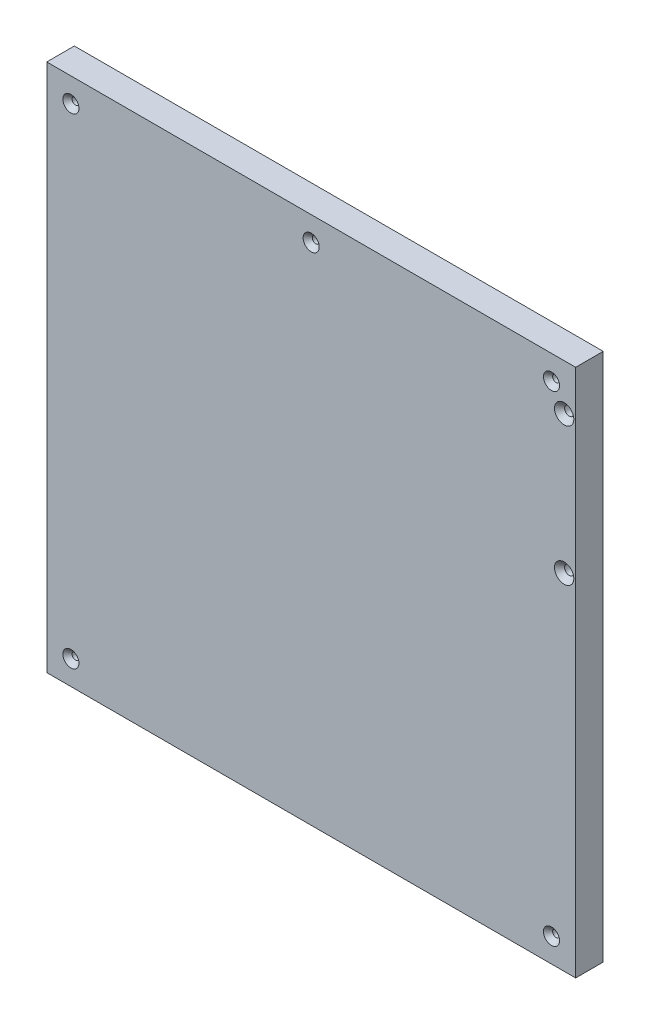
ISO-10303-21;
HEADER;
FILE_DESCRIPTION(('STEP AP214'),'2;1');
FILE_NAME('part.step','',(''),(''),'','','');
FILE_SCHEMA(('AUTOMOTIVE_DESIGN { 1 0 10303 214 1 1 1 1 }'));
ENDSEC;
DATA;
#1=APPLICATION_CONTEXT('core data for automotive mechanical design processes');
#2=APPLICATION_PROTOCOL_DEFINITION('international standard','automotive_design',2000,#1);
#3=PRODUCT_CONTEXT('',#1,'mechanical');
#4=PRODUCT('Part','Part','',(#3));
#5=PRODUCT_RELATED_PRODUCT_CATEGORY('part','',(#4));
#6=PRODUCT_DEFINITION_FORMATION('','',#4);
#7=PRODUCT_DEFINITION_CONTEXT('part definition',#1,'design');
#8=PRODUCT_DEFINITION('design','',#6,#7);
#9=PRODUCT_DEFINITION_SHAPE('','',#8);
#10=(LENGTH_UNIT() NAMED_UNIT(*) SI_UNIT(.MILLI.,.METRE.));
#11=(NAMED_UNIT(*) PLANE_ANGLE_UNIT() SI_UNIT($,.RADIAN.));
#12=(NAMED_UNIT(*) SI_UNIT($,.STERADIAN.) SOLID_ANGLE_UNIT());
#13=UNCERTAINTY_MEASURE_WITH_UNIT(LENGTH_MEASURE(1.E-05),#10,'distance_accuracy_value','');
#14=(GEOMETRIC_REPRESENTATION_CONTEXT(3) GLOBAL_UNCERTAINTY_ASSIGNED_CONTEXT((#13)) GLOBAL_UNIT_ASSIGNED_CONTEXT((#10,
#11,#12)) REPRESENTATION_CONTEXT('',''));
#15=CARTESIAN_POINT('',(0.,0.,0.));
#16=DIRECTION('',(0.,0.,1.));
#17=DIRECTION('',(1.,0.,0.));
#18=AXIS2_PLACEMENT_3D('',#15,#16,#17);
#19=CARTESIAN_POINT('',(0.,0.,12.));
#20=DIRECTION('',(0.,0.,-1.));
#21=DIRECTION('',(-1.,0.,0.));
#22=AXIS2_PLACEMENT_3D('',#19,#20,#21);
#23=PLANE('',#22);
#24=CARTESIAN_POINT('',(225.,150.,12.));
#25=DIRECTION('',(0.,0.,-1.));
#26=DIRECTION('',(-1.,0.,0.));
#27=AXIS2_PLACEMENT_3D('',#24,#25,#26);
#28=CIRCLE('',#27,4.20000000000004);
#29=CARTESIAN_POINT('',(220.8,150.,12.));
#30=VERTEX_POINT('',#29);
#31=EDGE_CURVE('E49',#30,#30,#28,.T.);
#32=ORIENTED_EDGE('',*,*,#31,.T.);
#33=EDGE_LOOP('',(#32));
#34=FACE_BOUND('',#33,.T.);
#35=CARTESIAN_POINT('',(225.,210.,12.));
#36=DIRECTION('',(0.,0.,-1.));
#37=DIRECTION('',(-1.,0.,0.));
#38=AXIS2_PLACEMENT_3D('',#35,#36,#37);
#39=CIRCLE('',#38,4.20000000000004);
#40=CARTESIAN_POINT('',(220.8,210.,12.));
#41=VERTEX_POINT('',#40);
#42=EDGE_CURVE('E172',#41,#41,#39,.T.);
#43=ORIENTED_EDGE('',*,*,#42,.T.);
#44=EDGE_LOOP('',(#43));
#45=FACE_BOUND('',#44,.T.);
#46=CARTESIAN_POINT('',(10.5,10.5,12.));
#47=DIRECTION('',(0.,0.,-1.));
#48=DIRECTION('',(-1.,0.,0.));
#49=AXIS2_PLACEMENT_3D('',#46,#47,#48);
#50=CIRCLE('',#49,3.50000000000006);
#51=CARTESIAN_POINT('',(6.99999999999998,10.5,12.));
#52=VERTEX_POINT('',#51);
#53=EDGE_CURVE('E148',#52,#52,#50,.T.);
#54=ORIENTED_EDGE('',*,*,#53,.T.);
#55=EDGE_LOOP('',(#54));
#56=FACE_BOUND('',#55,.T.);
#57=CARTESIAN_POINT('',(219.5,10.5,12.));
#58=DIRECTION('',(0.,0.,-1.));
#59=DIRECTION('',(-1.,0.,0.));
#60=AXIS2_PLACEMENT_3D('',#57,#58,#59);
#61=CIRCLE('',#60,3.50000000000006);
#62=CARTESIAN_POINT('',(216.,10.5,12.));
#63=VERTEX_POINT('',#62);
#64=EDGE_CURVE('E144',#63,#63,#61,.T.);
#65=ORIENTED_EDGE('',*,*,#64,.T.);
#66=EDGE_LOOP('',(#65));
#67=FACE_BOUND('',#66,.T.);
#68=CARTESIAN_POINT('',(10.5,219.5,12.));
#69=DIRECTION('',(0.,0.,-1.));
#70=DIRECTION('',(-1.,0.,0.));
#71=AXIS2_PLACEMENT_3D('',#68,#69,#70);
#72=CIRCLE('',#71,3.50000000000006);
#73=CARTESIAN_POINT('',(6.99999999999998,219.5,12.));
#74=VERTEX_POINT('',#73);
#75=EDGE_CURVE('E140',#74,#74,#72,.T.);
#76=ORIENTED_EDGE('',*,*,#75,.T.);
#77=EDGE_LOOP('',(#76));
#78=FACE_BOUND('',#77,.T.);
#79=CARTESIAN_POINT('',(115.,219.5,12.));
#80=DIRECTION('',(0.,0.,-1.));
#81=DIRECTION('',(-1.,0.,0.));
#82=AXIS2_PLACEMENT_3D('',#79,#80,#81);
#83=CIRCLE('',#82,3.50000000000006);
#84=CARTESIAN_POINT('',(111.5,219.5,12.));
#85=VERTEX_POINT('',#84);
#86=EDGE_CURVE('E136',#85,#85,#83,.T.);
#87=ORIENTED_EDGE('',*,*,#86,.T.);
#88=EDGE_LOOP('',(#87));
#89=FACE_BOUND('',#88,.T.);
#90=CARTESIAN_POINT('',(219.5,219.5,12.));
#91=DIRECTION('',(0.,0.,-1.));
#92=DIRECTION('',(-1.,0.,0.));
#93=AXIS2_PLACEMENT_3D('',#90,#91,#92);
#94=CIRCLE('',#93,3.50000000000006);
#95=CARTESIAN_POINT('',(216.,219.5,12.));
#96=VERTEX_POINT('',#95);
#97=EDGE_CURVE('E132',#96,#96,#94,.T.);
#98=ORIENTED_EDGE('',*,*,#97,.T.);
#99=EDGE_LOOP('',(#98));
#100=FACE_BOUND('',#99,.T.);
#101=DIRECTION('',(0.,-1.,0.));
#102=VECTOR('',#101,1.);
#103=CARTESIAN_POINT('',(0.,0.,12.));
#104=LINE('',#103,#102);
#105=CARTESIAN_POINT('',(0.,230.,12.));
#106=VERTEX_POINT('',#105);
#107=CARTESIAN_POINT('',(0.,0.,12.));
#108=VERTEX_POINT('',#107);
#109=EDGE_CURVE('E92',#106,#108,#104,.T.);
#110=ORIENTED_EDGE('',*,*,#109,.T.);
#111=DIRECTION('',(1.,0.,0.));
#112=VECTOR('',#111,1.);
#113=CARTESIAN_POINT('',(0.,0.,12.));
#114=LINE('',#113,#112);
#115=CARTESIAN_POINT('',(230.,0.,12.));
#116=VERTEX_POINT('',#115);
#117=EDGE_CURVE('E88',#108,#116,#114,.T.);
#118=ORIENTED_EDGE('',*,*,#117,.T.);
#119=DIRECTION('',(0.,1.,0.));
#120=VECTOR('',#119,1.);
#121=CARTESIAN_POINT('',(230.,0.,12.));
#122=LINE('',#121,#120);
#123=CARTESIAN_POINT('',(230.,230.,12.));
#124=VERTEX_POINT('',#123);
#125=EDGE_CURVE('E90',#116,#124,#122,.T.);
#126=ORIENTED_EDGE('',*,*,#125,.T.);
#127=DIRECTION('',(-1.,0.,0.));
#128=VECTOR('',#127,1.);
#129=CARTESIAN_POINT('',(0.,230.,12.));
#130=LINE('',#129,#128);
#131=EDGE_CURVE('E57',#124,#106,#130,.T.);
#132=ORIENTED_EDGE('',*,*,#131,.T.);
#133=EDGE_LOOP('',(#110,#118,#126,#132));
#134=FACE_BOUND('',#133,.T.);
#135=ADVANCED_FACE('F39',(#34,#45,#56,#67,#78,#89,#100,#134),#23,.F.);
#136=CARTESIAN_POINT('',(0.,0.,0.));
#137=DIRECTION('',(0.,0.,-1.));
#138=DIRECTION('',(-1.,0.,0.));
#139=AXIS2_PLACEMENT_3D('',#136,#137,#138);
#140=PLANE('',#139);
#141=CARTESIAN_POINT('',(225.,150.,0.));
#142=DIRECTION('',(0.,0.,1.));
#143=DIRECTION('',(1.,0.,0.));
#144=AXIS2_PLACEMENT_3D('',#141,#142,#143);
#145=CIRCLE('',#144,2.);
#146=CARTESIAN_POINT('',(227.,150.,0.));
#147=VERTEX_POINT('',#146);
#148=EDGE_CURVE('E195',#147,#147,#145,.T.);
#149=ORIENTED_EDGE('',*,*,#148,.T.);
#150=EDGE_LOOP('',(#149));
#151=FACE_BOUND('',#150,.T.);
#152=CARTESIAN_POINT('',(10.5,10.5,0.));
#153=DIRECTION('',(0.,0.,1.));
#154=DIRECTION('',(1.,0.,0.));
#155=AXIS2_PLACEMENT_3D('',#152,#153,#154);
#156=CIRCLE('',#155,1.5);
#157=CARTESIAN_POINT('',(12.,10.5,0.));
#158=VERTEX_POINT('',#157);
#159=EDGE_CURVE('E204',#158,#158,#156,.T.);
#160=ORIENTED_EDGE('',*,*,#159,.T.);
#161=EDGE_LOOP('',(#160));
#162=FACE_BOUND('',#161,.T.);
#163=CARTESIAN_POINT('',(219.5,219.5,0.));
#164=DIRECTION('',(0.,0.,1.));
#165=DIRECTION('',(1.,0.,0.));
#166=AXIS2_PLACEMENT_3D('',#163,#164,#165);
#167=CIRCLE('',#166,1.5);
#168=CARTESIAN_POINT('',(221.,219.5,0.));
#169=VERTEX_POINT('',#168);
#170=EDGE_CURVE('E216',#169,#169,#167,.T.);
#171=ORIENTED_EDGE('',*,*,#170,.T.);
#172=EDGE_LOOP('',(#171));
#173=FACE_BOUND('',#172,.T.);
#174=DIRECTION('',(0.,-1.,0.));
#175=VECTOR('',#174,1.);
#176=CARTESIAN_POINT('',(0.,0.,0.));
#177=LINE('',#176,#175);
#178=CARTESIAN_POINT('',(0.,230.,0.));
#179=VERTEX_POINT('',#178);
#180=CARTESIAN_POINT('',(0.,0.,0.));
#181=VERTEX_POINT('',#180);
#182=EDGE_CURVE('E111',#179,#181,#177,.T.);
#183=ORIENTED_EDGE('',*,*,#182,.F.);
#184=DIRECTION('',(-1.,0.,0.));
#185=VECTOR('',#184,1.);
#186=CARTESIAN_POINT('',(0.,230.,0.));
#187=LINE('',#186,#185);
#188=CARTESIAN_POINT('',(230.,230.,0.));
#189=VERTEX_POINT('',#188);
#190=EDGE_CURVE('E80',#189,#179,#187,.T.);
#191=ORIENTED_EDGE('',*,*,#190,.F.);
#192=DIRECTION('',(0.,1.,0.));
#193=VECTOR('',#192,1.);
#194=CARTESIAN_POINT('',(230.,0.,0.));
#195=LINE('',#194,#193);
#196=CARTESIAN_POINT('',(230.,0.,0.));
#197=VERTEX_POINT('',#196);
#198=EDGE_CURVE('E74',#197,#189,#195,.T.);
#199=ORIENTED_EDGE('',*,*,#198,.F.);
#200=DIRECTION('',(1.,0.,0.));
#201=VECTOR('',#200,1.);
#202=CARTESIAN_POINT('',(0.,0.,0.));
#203=LINE('',#202,#201);
#204=EDGE_CURVE('E98',#181,#197,#203,.T.);
#205=ORIENTED_EDGE('',*,*,#204,.F.);
#206=EDGE_LOOP('',(#183,#191,#199,#205));
#207=FACE_BOUND('',#206,.T.);
#208=CARTESIAN_POINT('',(219.5,10.5,0.));
#209=DIRECTION('',(0.,0.,1.));
#210=DIRECTION('',(1.,0.,0.));
#211=AXIS2_PLACEMENT_3D('',#208,#209,#210);
#212=CIRCLE('',#211,1.5);
#213=CARTESIAN_POINT('',(221.,10.5,0.));
#214=VERTEX_POINT('',#213);
#215=EDGE_CURVE('E115',#214,#214,#212,.T.);
#216=ORIENTED_EDGE('',*,*,#215,.T.);
#217=EDGE_LOOP('',(#216));
#218=FACE_BOUND('',#217,.T.);
#219=CARTESIAN_POINT('',(10.5,219.5,0.));
#220=DIRECTION('',(0.,0.,1.));
#221=DIRECTION('',(1.,0.,0.));
#222=AXIS2_PLACEMENT_3D('',#219,#220,#221);
#223=CIRCLE('',#222,1.5);
#224=CARTESIAN_POINT('',(12.,219.5,0.));
#225=VERTEX_POINT('',#224);
#226=EDGE_CURVE('E212',#225,#225,#223,.T.);
#227=ORIENTED_EDGE('',*,*,#226,.T.);
#228=EDGE_LOOP('',(#227));
#229=FACE_BOUND('',#228,.T.);
#230=CARTESIAN_POINT('',(115.,219.5,0.));
#231=DIRECTION('',(0.,0.,1.));
#232=DIRECTION('',(1.,0.,0.));
#233=AXIS2_PLACEMENT_3D('',#230,#231,#232);
#234=CIRCLE('',#233,1.5);
#235=CARTESIAN_POINT('',(116.5,219.5,0.));
#236=VERTEX_POINT('',#235);
#237=EDGE_CURVE('E198',#236,#236,#234,.T.);
#238=ORIENTED_EDGE('',*,*,#237,.T.);
#239=EDGE_LOOP('',(#238));
#240=FACE_BOUND('',#239,.T.);
#241=CARTESIAN_POINT('',(225.,210.,0.));
#242=DIRECTION('',(0.,0.,1.));
#243=DIRECTION('',(1.,0.,0.));
#244=AXIS2_PLACEMENT_3D('',#241,#242,#243);
#245=CIRCLE('',#244,2.);
#246=CARTESIAN_POINT('',(227.,210.,0.));
#247=VERTEX_POINT('',#246);
#248=EDGE_CURVE('E199',#247,#247,#245,.T.);
#249=ORIENTED_EDGE('',*,*,#248,.T.);
#250=EDGE_LOOP('',(#249));
#251=FACE_BOUND('',#250,.T.);
#252=ADVANCED_FACE('F225',(#151,#162,#173,#207,#218,#229,#240,#251),#140,.T.);
#253=CARTESIAN_POINT('',(0.,0.,12.));
#254=DIRECTION('',(1.,0.,0.));
#255=DIRECTION('',(0.,0.,-1.));
#256=AXIS2_PLACEMENT_3D('',#253,#254,#255);
#257=PLANE('',#256);
#258=ORIENTED_EDGE('',*,*,#182,.T.);
#259=DIRECTION('',(0.,0.,-1.));
#260=VECTOR('',#259,1.);
#261=CARTESIAN_POINT('',(0.,0.,12.));
#262=LINE('',#261,#260);
#263=EDGE_CURVE('E100',#108,#181,#262,.T.);
#264=ORIENTED_EDGE('',*,*,#263,.F.);
#265=ORIENTED_EDGE('',*,*,#109,.F.);
#266=DIRECTION('',(0.,0.,-1.));
#267=VECTOR('',#266,1.);
#268=CARTESIAN_POINT('',(0.,230.,12.));
#269=LINE('',#268,#267);
#270=EDGE_CURVE('E107',#106,#179,#269,.T.);
#271=ORIENTED_EDGE('',*,*,#270,.T.);
#272=EDGE_LOOP('',(#258,#264,#265,#271));
#273=FACE_BOUND('',#272,.T.);
#274=ADVANCED_FACE('F247',(#273),#257,.F.);
#275=CARTESIAN_POINT('',(0.,0.,12.));
#276=DIRECTION('',(0.,1.,0.));
#277=DIRECTION('',(0.,0.,1.));
#278=AXIS2_PLACEMENT_3D('',#275,#276,#277);
#279=PLANE('',#278);
#280=ORIENTED_EDGE('',*,*,#204,.T.);
#281=DIRECTION('',(0.,0.,-1.));
#282=VECTOR('',#281,1.);
#283=CARTESIAN_POINT('',(230.,0.,12.));
#284=LINE('',#283,#282);
#285=EDGE_CURVE('E96',#116,#197,#284,.T.);
#286=ORIENTED_EDGE('',*,*,#285,.F.);
#287=ORIENTED_EDGE('',*,*,#117,.F.);
#288=ORIENTED_EDGE('',*,*,#263,.T.);
#289=EDGE_LOOP('',(#280,#286,#287,#288));
#290=FACE_BOUND('',#289,.T.);
#291=ADVANCED_FACE('F97',(#290),#279,.F.);
#292=CARTESIAN_POINT('',(230.,0.,12.));
#293=DIRECTION('',(-1.,0.,0.));
#294=DIRECTION('',(0.,0.,1.));
#295=AXIS2_PLACEMENT_3D('',#292,#293,#294);
#296=PLANE('',#295);
#297=ORIENTED_EDGE('',*,*,#198,.T.);
#298=DIRECTION('',(0.,0.,-1.));
#299=VECTOR('',#298,1.);
#300=CARTESIAN_POINT('',(230.,230.,12.));
#301=LINE('',#300,#299);
#302=EDGE_CURVE('E101',#124,#189,#301,.T.);
#303=ORIENTED_EDGE('',*,*,#302,.F.);
#304=ORIENTED_EDGE('',*,*,#125,.F.);
#305=ORIENTED_EDGE('',*,*,#285,.T.);
#306=EDGE_LOOP('',(#297,#303,#304,#305));
#307=FACE_BOUND('',#306,.T.);
#308=ADVANCED_FACE('F103',(#307),#296,.F.);
#309=CARTESIAN_POINT('',(0.,230.,12.));
#310=DIRECTION('',(0.,-1.,0.));
#311=DIRECTION('',(0.,0.,-1.));
#312=AXIS2_PLACEMENT_3D('',#309,#310,#311);
#313=PLANE('',#312);
#314=ORIENTED_EDGE('',*,*,#190,.T.);
#315=ORIENTED_EDGE('',*,*,#270,.F.);
#316=ORIENTED_EDGE('',*,*,#131,.F.);
#317=ORIENTED_EDGE('',*,*,#302,.T.);
#318=EDGE_LOOP('',(#314,#315,#316,#317));
#319=FACE_BOUND('',#318,.T.);
#320=ADVANCED_FACE('F231',(#319),#313,.F.);
#321=CARTESIAN_POINT('',(219.5,10.5,12.));
#322=DIRECTION('',(0.,0.,-1.));
#323=DIRECTION('',(-1.,0.,0.));
#324=AXIS2_PLACEMENT_3D('',#321,#322,#323);
#325=CYLINDRICAL_SURFACE('',#324,1.5);
#326=CARTESIAN_POINT('',(219.5,10.5,9.99999999999993));
#327=DIRECTION('',(0.,0.,-1.));
#328=DIRECTION('',(-1.,0.,0.));
#329=AXIS2_PLACEMENT_3D('',#326,#327,#328);
#330=CIRCLE('',#329,1.5);
#331=CARTESIAN_POINT('',(218.,10.5,9.99999999999993));
#332=VERTEX_POINT('',#331);
#333=EDGE_CURVE('E152',#332,#332,#330,.F.);
#334=ORIENTED_EDGE('',*,*,#333,.T.);
#335=EDGE_LOOP('',(#334));
#336=FACE_BOUND('',#335,.T.);
#337=ORIENTED_EDGE('',*,*,#215,.F.);
#338=EDGE_LOOP('',(#337));
#339=FACE_BOUND('',#338,.T.);
#340=ADVANCED_FACE('F228',(#336,#339),#325,.F.);
#341=CARTESIAN_POINT('',(219.5,219.5,12.));
#342=DIRECTION('',(0.,0.,-1.));
#343=DIRECTION('',(-1.,0.,0.));
#344=AXIS2_PLACEMENT_3D('',#341,#342,#343);
#345=CYLINDRICAL_SURFACE('',#344,1.5);
#346=CARTESIAN_POINT('',(219.5,219.5,9.99999999999993));
#347=DIRECTION('',(0.,0.,-1.));
#348=DIRECTION('',(-1.,0.,0.));
#349=AXIS2_PLACEMENT_3D('',#346,#347,#348);
#350=CIRCLE('',#349,1.5);
#351=CARTESIAN_POINT('',(218.,219.5,9.99999999999993));
#352=VERTEX_POINT('',#351);
#353=EDGE_CURVE('E164',#352,#352,#350,.F.);
#354=ORIENTED_EDGE('',*,*,#353,.T.);
#355=EDGE_LOOP('',(#354));
#356=FACE_BOUND('',#355,.T.);
#357=ORIENTED_EDGE('',*,*,#170,.F.);
#358=EDGE_LOOP('',(#357));
#359=FACE_BOUND('',#358,.T.);
#360=ADVANCED_FACE('F230',(#356,#359),#345,.F.);
#361=CARTESIAN_POINT('',(10.5,219.5,12.));
#362=DIRECTION('',(0.,0.,-1.));
#363=DIRECTION('',(-1.,0.,0.));
#364=AXIS2_PLACEMENT_3D('',#361,#362,#363);
#365=CYLINDRICAL_SURFACE('',#364,1.5);
#366=CARTESIAN_POINT('',(10.5,219.5,9.99999999999997));
#367=DIRECTION('',(0.,0.,-1.));
#368=DIRECTION('',(-1.,0.,0.));
#369=AXIS2_PLACEMENT_3D('',#366,#367,#368);
#370=CIRCLE('',#369,1.5);
#371=CARTESIAN_POINT('',(9.00000000000004,219.5,9.99999999999997));
#372=VERTEX_POINT('',#371);
#373=EDGE_CURVE('E156',#372,#372,#370,.F.);
#374=ORIENTED_EDGE('',*,*,#373,.T.);
#375=EDGE_LOOP('',(#374));
#376=FACE_BOUND('',#375,.T.);
#377=ORIENTED_EDGE('',*,*,#226,.F.);
#378=EDGE_LOOP('',(#377));
#379=FACE_BOUND('',#378,.T.);
#380=ADVANCED_FACE('F238',(#376,#379),#365,.F.);
#381=CARTESIAN_POINT('',(10.5,10.5,12.));
#382=DIRECTION('',(0.,0.,-1.));
#383=DIRECTION('',(-1.,0.,0.));
#384=AXIS2_PLACEMENT_3D('',#381,#382,#383);
#385=CYLINDRICAL_SURFACE('',#384,1.5);
#386=CARTESIAN_POINT('',(10.5,10.5,9.99999999999996));
#387=DIRECTION('',(0.,0.,-1.));
#388=DIRECTION('',(-1.,0.,0.));
#389=AXIS2_PLACEMENT_3D('',#386,#387,#388);
#390=CIRCLE('',#389,1.5);
#391=CARTESIAN_POINT('',(9.00000000000004,10.5,9.99999999999996));
#392=VERTEX_POINT('',#391);
#393=EDGE_CURVE('E128',#392,#392,#390,.F.);
#394=ORIENTED_EDGE('',*,*,#393,.T.);
#395=EDGE_LOOP('',(#394));
#396=FACE_BOUND('',#395,.T.);
#397=ORIENTED_EDGE('',*,*,#159,.F.);
#398=EDGE_LOOP('',(#397));
#399=FACE_BOUND('',#398,.T.);
#400=ADVANCED_FACE('F344',(#396,#399),#385,.F.);
#401=CARTESIAN_POINT('',(115.,219.5,12.));
#402=DIRECTION('',(0.,0.,-1.));
#403=DIRECTION('',(-1.,0.,0.));
#404=AXIS2_PLACEMENT_3D('',#401,#402,#403);
#405=CYLINDRICAL_SURFACE('',#404,1.5);
#406=CARTESIAN_POINT('',(115.,219.5,9.99999999999993));
#407=DIRECTION('',(0.,0.,-1.));
#408=DIRECTION('',(-1.,0.,0.));
#409=AXIS2_PLACEMENT_3D('',#406,#407,#408);
#410=CIRCLE('',#409,1.5);
#411=CARTESIAN_POINT('',(113.5,219.5,9.99999999999993));
#412=VERTEX_POINT('',#411);
#413=EDGE_CURVE('E160',#412,#412,#410,.F.);
#414=ORIENTED_EDGE('',*,*,#413,.T.);
#415=EDGE_LOOP('',(#414));
#416=FACE_BOUND('',#415,.T.);
#417=ORIENTED_EDGE('',*,*,#237,.F.);
#418=EDGE_LOOP('',(#417));
#419=FACE_BOUND('',#418,.T.);
#420=ADVANCED_FACE('F191',(#416,#419),#405,.F.);
#421=CARTESIAN_POINT('',(225.,150.,12.));
#422=DIRECTION('',(0.,0.,-1.));
#423=DIRECTION('',(-1.,0.,0.));
#424=AXIS2_PLACEMENT_3D('',#421,#422,#423);
#425=CYLINDRICAL_SURFACE('',#424,2.);
#426=CARTESIAN_POINT('',(225.,150.,9.79999999999995));
#427=DIRECTION('',(0.,0.,-1.));
#428=DIRECTION('',(-1.,0.,0.));
#429=AXIS2_PLACEMENT_3D('',#426,#427,#428);
#430=CIRCLE('',#429,2.);
#431=CARTESIAN_POINT('',(223.,150.,9.79999999999995));
#432=VERTEX_POINT('',#431);
#433=EDGE_CURVE('E168',#432,#432,#430,.F.);
#434=ORIENTED_EDGE('',*,*,#433,.T.);
#435=EDGE_LOOP('',(#434));
#436=FACE_BOUND('',#435,.T.);
#437=ORIENTED_EDGE('',*,*,#148,.F.);
#438=EDGE_LOOP('',(#437));
#439=FACE_BOUND('',#438,.T.);
#440=ADVANCED_FACE('F187',(#436,#439),#425,.F.);
#441=CARTESIAN_POINT('',(225.,210.,12.));
#442=DIRECTION('',(0.,0.,-1.));
#443=DIRECTION('',(-1.,0.,0.));
#444=AXIS2_PLACEMENT_3D('',#441,#442,#443);
#445=CYLINDRICAL_SURFACE('',#444,2.);
#446=CARTESIAN_POINT('',(225.,210.,9.79999999999995));
#447=DIRECTION('',(0.,0.,-1.));
#448=DIRECTION('',(-1.,0.,0.));
#449=AXIS2_PLACEMENT_3D('',#446,#447,#448);
#450=CIRCLE('',#449,2.);
#451=CARTESIAN_POINT('',(223.,210.,9.79999999999995));
#452=VERTEX_POINT('',#451);
#453=EDGE_CURVE('E11',#452,#452,#450,.F.);
#454=ORIENTED_EDGE('',*,*,#453,.T.);
#455=EDGE_LOOP('',(#454));
#456=FACE_BOUND('',#455,.T.);
#457=ORIENTED_EDGE('',*,*,#248,.F.);
#458=EDGE_LOOP('',(#457));
#459=FACE_BOUND('',#458,.T.);
#460=ADVANCED_FACE('F190',(#456,#459),#445,.F.);
#461=CARTESIAN_POINT('',(10.5,10.5,9.99999999999996));
#462=DIRECTION('',(0.,0.,1.));
#463=DIRECTION('',(1.,0.,0.));
#464=AXIS2_PLACEMENT_3D('',#461,#462,#463);
#465=CONICAL_SURFACE('',#464,1.5,0.785398163397454);
#466=ORIENTED_EDGE('',*,*,#53,.F.);
#467=EDGE_LOOP('',(#466));
#468=FACE_BOUND('',#467,.T.);
#469=ORIENTED_EDGE('',*,*,#393,.F.);
#470=EDGE_LOOP('',(#469));
#471=FACE_BOUND('',#470,.T.);
#472=ADVANCED_FACE('F257',(#468,#471),#465,.F.);
#473=CARTESIAN_POINT('',(219.5,10.5,9.99999999999993));
#474=DIRECTION('',(0.,0.,1.));
#475=DIRECTION('',(1.,0.,0.));
#476=AXIS2_PLACEMENT_3D('',#473,#474,#475);
#477=CONICAL_SURFACE('',#476,1.5,0.785398163397447);
#478=ORIENTED_EDGE('',*,*,#64,.F.);
#479=EDGE_LOOP('',(#478));
#480=FACE_BOUND('',#479,.T.);
#481=ORIENTED_EDGE('',*,*,#333,.F.);
#482=EDGE_LOOP('',(#481));
#483=FACE_BOUND('',#482,.T.);
#484=ADVANCED_FACE('F260',(#480,#483),#477,.F.);
#485=CARTESIAN_POINT('',(10.5,219.5,9.99999999999997));
#486=DIRECTION('',(0.,0.,1.));
#487=DIRECTION('',(1.,0.,0.));
#488=AXIS2_PLACEMENT_3D('',#485,#486,#487);
#489=CONICAL_SURFACE('',#488,1.5,0.785398163397454);
#490=ORIENTED_EDGE('',*,*,#75,.F.);
#491=EDGE_LOOP('',(#490));
#492=FACE_BOUND('',#491,.T.);
#493=ORIENTED_EDGE('',*,*,#373,.F.);
#494=EDGE_LOOP('',(#493));
#495=FACE_BOUND('',#494,.T.);
#496=ADVANCED_FACE('F264',(#492,#495),#489,.F.);
#497=CARTESIAN_POINT('',(115.,219.5,9.99999999999993));
#498=DIRECTION('',(0.,0.,1.));
#499=DIRECTION('',(1.,0.,0.));
#500=AXIS2_PLACEMENT_3D('',#497,#498,#499);
#501=CONICAL_SURFACE('',#500,1.5,0.785398163397447);
#502=ORIENTED_EDGE('',*,*,#86,.F.);
#503=EDGE_LOOP('',(#502));
#504=FACE_BOUND('',#503,.T.);
#505=ORIENTED_EDGE('',*,*,#413,.F.);
#506=EDGE_LOOP('',(#505));
#507=FACE_BOUND('',#506,.T.);
#508=ADVANCED_FACE('F268',(#504,#507),#501,.F.);
#509=CARTESIAN_POINT('',(219.5,219.5,9.99999999999993));
#510=DIRECTION('',(0.,0.,1.));
#511=DIRECTION('',(1.,0.,0.));
#512=AXIS2_PLACEMENT_3D('',#509,#510,#511);
#513=CONICAL_SURFACE('',#512,1.5,0.785398163397447);
#514=ORIENTED_EDGE('',*,*,#97,.F.);
#515=EDGE_LOOP('',(#514));
#516=FACE_BOUND('',#515,.T.);
#517=ORIENTED_EDGE('',*,*,#353,.F.);
#518=EDGE_LOOP('',(#517));
#519=FACE_BOUND('',#518,.T.);
#520=ADVANCED_FACE('F184',(#516,#519),#513,.F.);
#521=CARTESIAN_POINT('',(225.,150.,9.79999999999995));
#522=DIRECTION('',(0.,0.,1.));
#523=DIRECTION('',(1.,0.,0.));
#524=AXIS2_PLACEMENT_3D('',#521,#522,#523);
#525=CONICAL_SURFACE('',#524,2.,0.785398163397447);
#526=ORIENTED_EDGE('',*,*,#31,.F.);
#527=EDGE_LOOP('',(#526));
#528=FACE_BOUND('',#527,.T.);
#529=ORIENTED_EDGE('',*,*,#433,.F.);
#530=EDGE_LOOP('',(#529));
#531=FACE_BOUND('',#530,.T.);
#532=ADVANCED_FACE('F181',(#528,#531),#525,.F.);
#533=CARTESIAN_POINT('',(225.,210.,9.79999999999995));
#534=DIRECTION('',(0.,0.,1.));
#535=DIRECTION('',(1.,0.,0.));
#536=AXIS2_PLACEMENT_3D('',#533,#534,#535);
#537=CONICAL_SURFACE('',#536,2.,0.785398163397447);
#538=ORIENTED_EDGE('',*,*,#42,.F.);
#539=EDGE_LOOP('',(#538));
#540=FACE_BOUND('',#539,.T.);
#541=ORIENTED_EDGE('',*,*,#453,.F.);
#542=EDGE_LOOP('',(#541));
#543=FACE_BOUND('',#542,.T.);
#544=ADVANCED_FACE('F41',(#540,#543),#537,.F.);
#545=CLOSED_SHELL('',(#135,#252,#274,#291,#308,#320,#340,#360,#380,#400,#420,#440,#460,#472,
#484,#496,#508,#520,#532,#544));
#546=MANIFOLD_SOLID_BREP('B2',#545);
#547=ADVANCED_BREP_SHAPE_REPRESENTATION('',(#18,#546),#14);
#548=SHAPE_DEFINITION_REPRESENTATION(#9,#547);
ENDSEC;
END-ISO-10303-21;
